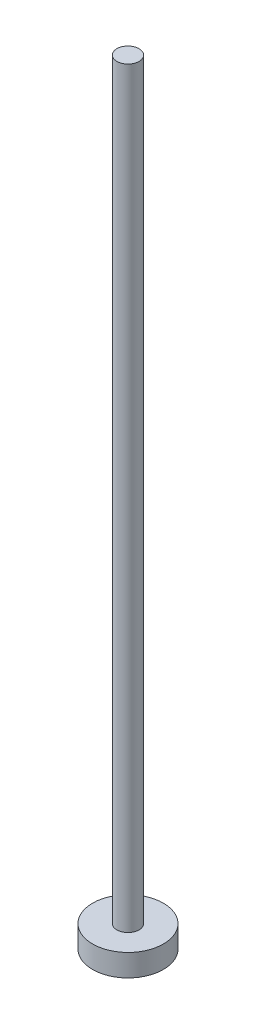
ISO-10303-21;
HEADER;
FILE_DESCRIPTION(('STEP AP214'),'2;1');
FILE_NAME('part.step','',(''),(''),'','','');
FILE_SCHEMA(('AUTOMOTIVE_DESIGN { 1 0 10303 214 1 1 1 1 }'));
ENDSEC;
DATA;
#1=APPLICATION_CONTEXT('core data for automotive mechanical design processes');
#2=APPLICATION_PROTOCOL_DEFINITION('international standard','automotive_design',2000,#1);
#3=PRODUCT_CONTEXT('',#1,'mechanical');
#4=PRODUCT('Part','Part','',(#3));
#5=PRODUCT_RELATED_PRODUCT_CATEGORY('part','',(#4));
#6=PRODUCT_DEFINITION_FORMATION('','',#4);
#7=PRODUCT_DEFINITION_CONTEXT('part definition',#1,'design');
#8=PRODUCT_DEFINITION('design','',#6,#7);
#9=PRODUCT_DEFINITION_SHAPE('','',#8);
#10=(LENGTH_UNIT() NAMED_UNIT(*) SI_UNIT(.MILLI.,.METRE.));
#11=(NAMED_UNIT(*) PLANE_ANGLE_UNIT() SI_UNIT($,.RADIAN.));
#12=(NAMED_UNIT(*) SI_UNIT($,.STERADIAN.) SOLID_ANGLE_UNIT());
#13=UNCERTAINTY_MEASURE_WITH_UNIT(LENGTH_MEASURE(1.E-05),#10,'distance_accuracy_value','');
#14=(GEOMETRIC_REPRESENTATION_CONTEXT(3) GLOBAL_UNCERTAINTY_ASSIGNED_CONTEXT((#13)) GLOBAL_UNIT_ASSIGNED_CONTEXT((#10,
#11,#12)) REPRESENTATION_CONTEXT('',''));
#15=CARTESIAN_POINT('',(0.,0.,0.));
#16=DIRECTION('',(0.,0.,1.));
#17=DIRECTION('',(1.,0.,0.));
#18=AXIS2_PLACEMENT_3D('',#15,#16,#17);
#19=CARTESIAN_POINT('',(2.5,175.,0.));
#20=DIRECTION('',(0.,-1.,0.));
#21=DIRECTION('',(1.,0.,0.));
#22=AXIS2_PLACEMENT_3D('',#19,#20,#21);
#23=PLANE('',#22);
#24=CARTESIAN_POINT('',(0.,175.,0.));
#25=DIRECTION('',(0.,1.,0.));
#26=DIRECTION('',(-1.,0.,0.));
#27=AXIS2_PLACEMENT_3D('',#24,#25,#26);
#28=CIRCLE('',#27,2.50000000000001);
#29=CARTESIAN_POINT('',(-2.50000000000002,175.,0.));
#30=VERTEX_POINT('',#29);
#31=EDGE_CURVE('E46',#30,#30,#28,.T.);
#32=ORIENTED_EDGE('',*,*,#31,.T.);
#33=EDGE_LOOP('',(#32));
#34=FACE_BOUND('',#33,.T.);
#35=ADVANCED_FACE('F32',(#34),#23,.F.);
#36=CARTESIAN_POINT('',(0.,0.,0.));
#37=DIRECTION('',(0.,1.,0.));
#38=DIRECTION('',(-1.,0.,0.));
#39=AXIS2_PLACEMENT_3D('',#36,#37,#38);
#40=PLANE('',#39);
#41=CARTESIAN_POINT('',(0.,0.,0.));
#42=DIRECTION('',(0.,1.,0.));
#43=DIRECTION('',(-1.,0.,0.));
#44=AXIS2_PLACEMENT_3D('',#41,#42,#43);
#45=CIRCLE('',#44,8.);
#46=CARTESIAN_POINT('',(-8.,0.,0.));
#47=VERTEX_POINT('',#46);
#48=EDGE_CURVE('E10',#47,#47,#45,.T.);
#49=ORIENTED_EDGE('',*,*,#48,.F.);
#50=EDGE_LOOP('',(#49));
#51=FACE_BOUND('',#50,.T.);
#52=ADVANCED_FACE('F66',(#51),#40,.F.);
#53=CARTESIAN_POINT('',(0.,175.,0.));
#54=DIRECTION('',(0.,1.,0.));
#55=DIRECTION('',(-1.,0.,0.));
#56=AXIS2_PLACEMENT_3D('',#53,#54,#55);
#57=CYLINDRICAL_SURFACE('',#56,8.);
#58=CARTESIAN_POINT('',(0.,5.,0.));
#59=DIRECTION('',(0.,1.,0.));
#60=DIRECTION('',(-1.,0.,0.));
#61=AXIS2_PLACEMENT_3D('',#58,#59,#60);
#62=CIRCLE('',#61,8.);
#63=CARTESIAN_POINT('',(-8.,5.,0.));
#64=VERTEX_POINT('',#63);
#65=EDGE_CURVE('E38',#64,#64,#62,.T.);
#66=ORIENTED_EDGE('',*,*,#65,.F.);
#67=EDGE_LOOP('',(#66));
#68=FACE_BOUND('',#67,.T.);
#69=ORIENTED_EDGE('',*,*,#48,.T.);
#70=EDGE_LOOP('',(#69));
#71=FACE_BOUND('',#70,.T.);
#72=ADVANCED_FACE('F61',(#68,#71),#57,.T.);
#73=CARTESIAN_POINT('',(8.,5.,0.));
#74=DIRECTION('',(0.,-1.,0.));
#75=DIRECTION('',(1.,0.,0.));
#76=AXIS2_PLACEMENT_3D('',#73,#74,#75);
#77=PLANE('',#76);
#78=CARTESIAN_POINT('',(0.,5.,0.));
#79=DIRECTION('',(0.,1.,0.));
#80=DIRECTION('',(-1.,0.,0.));
#81=AXIS2_PLACEMENT_3D('',#78,#79,#80);
#82=CIRCLE('',#81,2.5);
#83=CARTESIAN_POINT('',(-2.5,5.,0.));
#84=VERTEX_POINT('',#83);
#85=EDGE_CURVE('E42',#84,#84,#82,.T.);
#86=ORIENTED_EDGE('',*,*,#85,.F.);
#87=EDGE_LOOP('',(#86));
#88=FACE_BOUND('',#87,.T.);
#89=ORIENTED_EDGE('',*,*,#65,.T.);
#90=EDGE_LOOP('',(#89));
#91=FACE_BOUND('',#90,.T.);
#92=ADVANCED_FACE('F56',(#88,#91),#77,.F.);
#93=CARTESIAN_POINT('',(0.,175.,0.));
#94=DIRECTION('',(0.,1.,0.));
#95=DIRECTION('',(-1.,0.,0.));
#96=AXIS2_PLACEMENT_3D('',#93,#94,#95);
#97=CYLINDRICAL_SURFACE('',#96,2.50000000000001);
#98=ORIENTED_EDGE('',*,*,#31,.F.);
#99=EDGE_LOOP('',(#98));
#100=FACE_BOUND('',#99,.T.);
#101=ORIENTED_EDGE('',*,*,#85,.T.);
#102=EDGE_LOOP('',(#101));
#103=FACE_BOUND('',#102,.T.);
#104=ADVANCED_FACE('F53',(#100,#103),#97,.T.);
#105=CLOSED_SHELL('',(#35,#52,#72,#92,#104));
#106=MANIFOLD_SOLID_BREP('B2',#105);
#107=ADVANCED_BREP_SHAPE_REPRESENTATION('',(#18,#106),#14);
#108=SHAPE_DEFINITION_REPRESENTATION(#9,#107);
ENDSEC;
END-ISO-10303-21;
